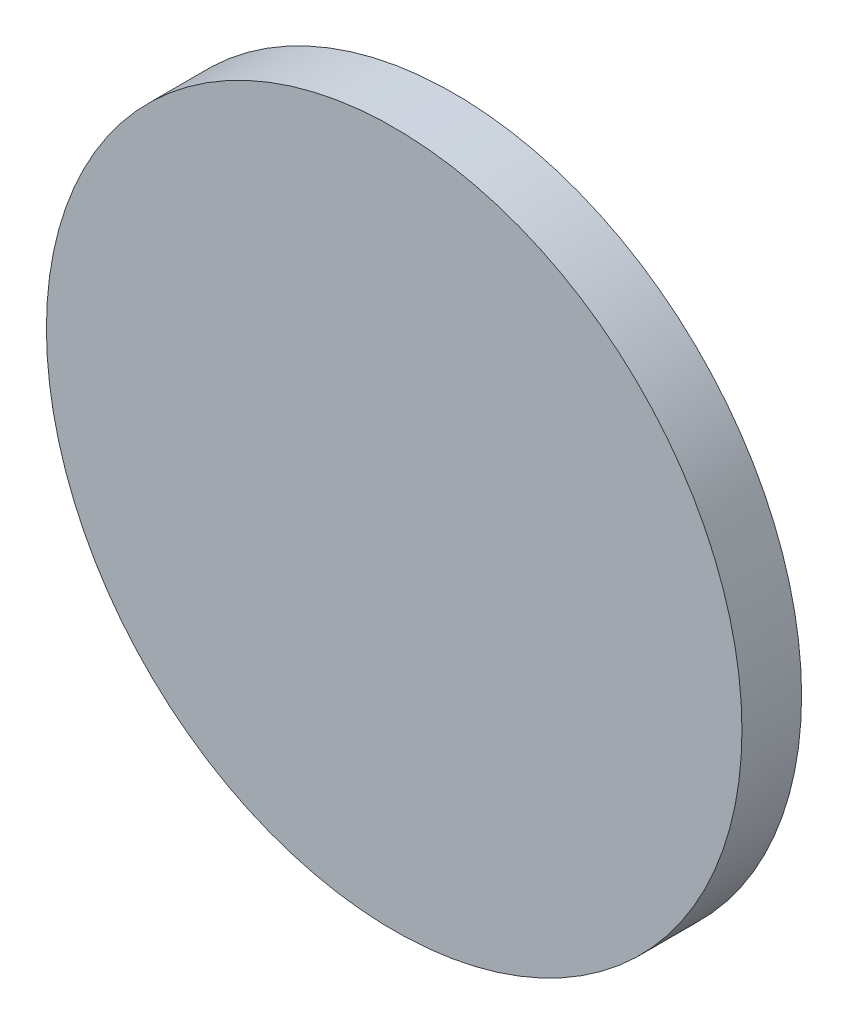
ISO-10303-21;
HEADER;
FILE_DESCRIPTION(('STEP AP214'),'2;1');
FILE_NAME('part.step','',(''),(''),'','','');
FILE_SCHEMA(('AUTOMOTIVE_DESIGN { 1 0 10303 214 1 1 1 1 }'));
ENDSEC;
DATA;
#1=APPLICATION_CONTEXT('core data for automotive mechanical design processes');
#2=APPLICATION_PROTOCOL_DEFINITION('international standard','automotive_design',2000,#1);
#3=PRODUCT_CONTEXT('',#1,'mechanical');
#4=PRODUCT('Part','Part','',(#3));
#5=PRODUCT_RELATED_PRODUCT_CATEGORY('part','',(#4));
#6=PRODUCT_DEFINITION_FORMATION('','',#4);
#7=PRODUCT_DEFINITION_CONTEXT('part definition',#1,'design');
#8=PRODUCT_DEFINITION('design','',#6,#7);
#9=PRODUCT_DEFINITION_SHAPE('','',#8);
#10=(LENGTH_UNIT() NAMED_UNIT(*) SI_UNIT(.MILLI.,.METRE.));
#11=(NAMED_UNIT(*) PLANE_ANGLE_UNIT() SI_UNIT($,.RADIAN.));
#12=(NAMED_UNIT(*) SI_UNIT($,.STERADIAN.) SOLID_ANGLE_UNIT());
#13=UNCERTAINTY_MEASURE_WITH_UNIT(LENGTH_MEASURE(1.E-05),#10,'distance_accuracy_value','');
#14=(GEOMETRIC_REPRESENTATION_CONTEXT(3) GLOBAL_UNCERTAINTY_ASSIGNED_CONTEXT((#13)) GLOBAL_UNIT_ASSIGNED_CONTEXT((#10,
#11,#12)) REPRESENTATION_CONTEXT('',''));
#15=CARTESIAN_POINT('',(0.,0.,0.));
#16=DIRECTION('',(0.,0.,1.));
#17=DIRECTION('',(1.,0.,0.));
#18=AXIS2_PLACEMENT_3D('',#15,#16,#17);
#19=CARTESIAN_POINT('',(3.81254,2.146300006176,0.03429));
#20=DIRECTION('',(0.,0.,1.));
#21=DIRECTION('',(1.,0.,0.));
#22=AXIS2_PLACEMENT_3D('',#19,#20,#21);
#23=PLANE('',#22);
#24=CARTESIAN_POINT('',(3.81254,2.146300006176,0.03429));
#25=DIRECTION('',(0.,0.,1.));
#26=DIRECTION('',(1.,0.,0.));
#27=AXIS2_PLACEMENT_3D('',#24,#25,#26);
#28=CIRCLE('',#27,0.200024667);
#29=CARTESIAN_POINT('',(4.012564667,2.146300006176,0.03429));
#30=VERTEX_POINT('',#29);
#31=EDGE_CURVE('E18',#30,#30,#28,.F.);
#32=ORIENTED_EDGE('',*,*,#31,.F.);
#33=EDGE_LOOP('',(#32));
#34=FACE_BOUND('',#33,.T.);
#35=ADVANCED_FACE('F15',(#34),#23,.T.);
#36=CARTESIAN_POINT('',(3.81254,2.146300006176,0.));
#37=DIRECTION('',(0.,0.,1.));
#38=DIRECTION('',(1.,0.,0.));
#39=AXIS2_PLACEMENT_3D('',#36,#37,#38);
#40=CYLINDRICAL_SURFACE('',#39,0.200024667);
#41=ORIENTED_EDGE('',*,*,#31,.T.);
#42=EDGE_LOOP('',(#41));
#43=FACE_BOUND('',#42,.T.);
#44=CARTESIAN_POINT('',(3.81254,2.146300006176,0.));
#45=DIRECTION('',(0.,0.,1.));
#46=DIRECTION('',(1.,0.,0.));
#47=AXIS2_PLACEMENT_3D('',#44,#45,#46);
#48=CIRCLE('',#47,0.200024667);
#49=CARTESIAN_POINT('',(4.012564667,2.146300006176,0.));
#50=VERTEX_POINT('',#49);
#51=EDGE_CURVE('E10',#50,#50,#48,.F.);
#52=ORIENTED_EDGE('',*,*,#51,.F.);
#53=EDGE_LOOP('',(#52));
#54=FACE_BOUND('',#53,.T.);
#55=ADVANCED_FACE('F27',(#43,#54),#40,.T.);
#56=CARTESIAN_POINT('',(3.81254,2.146300006176,0.));
#57=DIRECTION('',(0.,0.,-1.));
#58=DIRECTION('',(-1.,0.,0.));
#59=AXIS2_PLACEMENT_3D('',#56,#57,#58);
#60=PLANE('',#59);
#61=ORIENTED_EDGE('',*,*,#51,.T.);
#62=EDGE_LOOP('',(#61));
#63=FACE_BOUND('',#62,.T.);
#64=ADVANCED_FACE('F35',(#63),#60,.T.);
#65=CLOSED_SHELL('',(#35,#55,#64));
#66=MANIFOLD_SOLID_BREP('B1',#65);
#67=ADVANCED_BREP_SHAPE_REPRESENTATION('',(#18,#66),#14);
#68=SHAPE_DEFINITION_REPRESENTATION(#9,#67);
ENDSEC;
END-ISO-10303-21;
